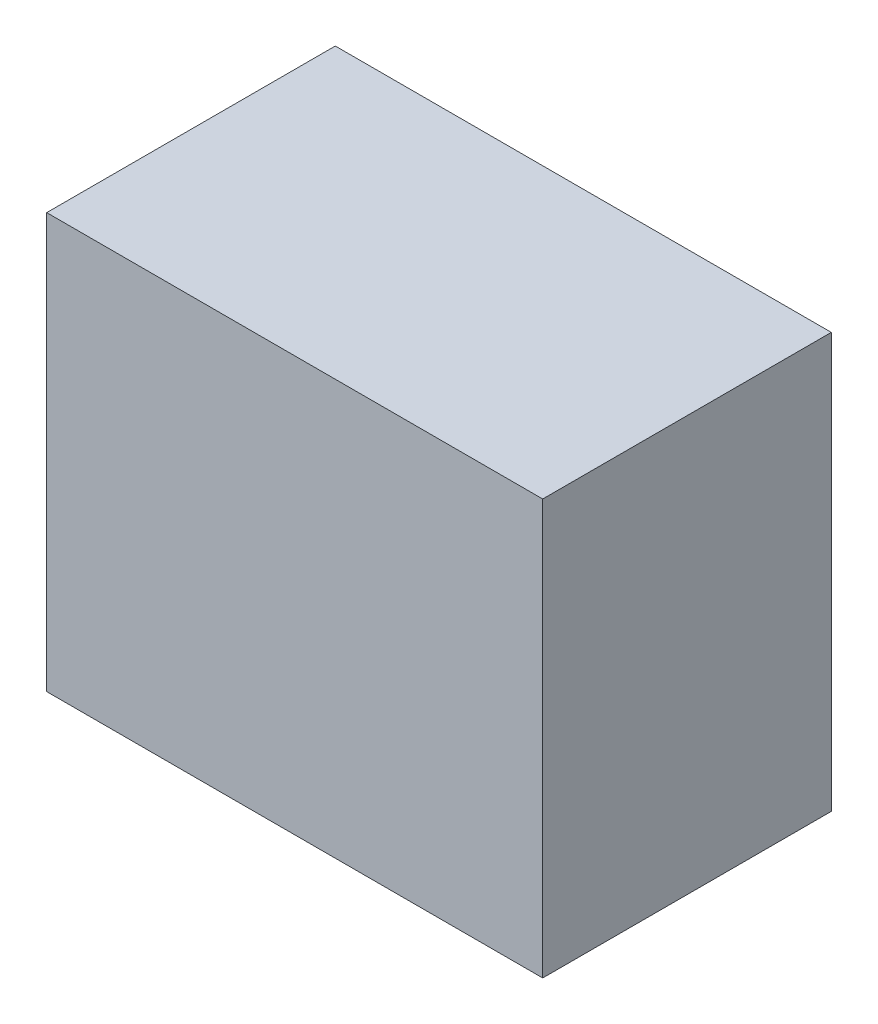
ISO-10303-21;
HEADER;
FILE_DESCRIPTION(('STEP AP214'),'2;1');
FILE_NAME('part.step','',(''),(''),'','','');
FILE_SCHEMA(('AUTOMOTIVE_DESIGN { 1 0 10303 214 1 1 1 1 }'));
ENDSEC;
DATA;
#1=APPLICATION_CONTEXT('core data for automotive mechanical design processes');
#2=APPLICATION_PROTOCOL_DEFINITION('international standard','automotive_design',2000,#1);
#3=PRODUCT_CONTEXT('',#1,'mechanical');
#4=PRODUCT('Part','Part','',(#3));
#5=PRODUCT_RELATED_PRODUCT_CATEGORY('part','',(#4));
#6=PRODUCT_DEFINITION_FORMATION('','',#4);
#7=PRODUCT_DEFINITION_CONTEXT('part definition',#1,'design');
#8=PRODUCT_DEFINITION('design','',#6,#7);
#9=PRODUCT_DEFINITION_SHAPE('','',#8);
#10=(LENGTH_UNIT() NAMED_UNIT(*) SI_UNIT(.MILLI.,.METRE.));
#11=(NAMED_UNIT(*) PLANE_ANGLE_UNIT() SI_UNIT($,.RADIAN.));
#12=(NAMED_UNIT(*) SI_UNIT($,.STERADIAN.) SOLID_ANGLE_UNIT());
#13=UNCERTAINTY_MEASURE_WITH_UNIT(LENGTH_MEASURE(1.E-05),#10,'distance_accuracy_value','');
#14=(GEOMETRIC_REPRESENTATION_CONTEXT(3) GLOBAL_UNCERTAINTY_ASSIGNED_CONTEXT((#13)) GLOBAL_UNIT_ASSIGNED_CONTEXT((#10,
#11,#12)) REPRESENTATION_CONTEXT('',''));
#15=CARTESIAN_POINT('',(0.,0.,0.));
#16=DIRECTION('',(0.,0.,1.));
#17=DIRECTION('',(1.,0.,0.));
#18=AXIS2_PLACEMENT_3D('',#15,#16,#17);
#19=CARTESIAN_POINT('',(-0.68749926,0.57500012,0.80000094));
#20=DIRECTION('',(0.,0.,-1.));
#21=DIRECTION('',(-1.,0.,0.));
#22=AXIS2_PLACEMENT_3D('',#19,#20,#21);
#23=PLANE('',#22);
#24=DIRECTION('',(1.,0.,0.));
#25=VECTOR('',#24,1.);
#26=CARTESIAN_POINT('',(-0.68749926,-0.57500012,0.80000094));
#27=LINE('',#26,#25);
#28=CARTESIAN_POINT('',(-0.68749926,-0.57500012,0.80000094));
#29=VERTEX_POINT('',#28);
#30=CARTESIAN_POINT('',(0.6875018,-0.57500012,0.80000094));
#31=VERTEX_POINT('',#30);
#32=EDGE_CURVE('E55',#29,#31,#27,.T.);
#33=ORIENTED_EDGE('',*,*,#32,.T.);
#34=DIRECTION('',(0.,1.,0.));
#35=VECTOR('',#34,1.);
#36=CARTESIAN_POINT('',(0.6875018,-0.57500012,0.80000094));
#37=LINE('',#36,#35);
#38=CARTESIAN_POINT('',(0.6875018,0.57500012,0.80000094));
#39=VERTEX_POINT('',#38);
#40=EDGE_CURVE('E57',#31,#39,#37,.T.);
#41=ORIENTED_EDGE('',*,*,#40,.T.);
#42=DIRECTION('',(1.,0.,0.));
#43=VECTOR('',#42,1.);
#44=CARTESIAN_POINT('',(0.6875018,0.57500012,0.80000094));
#45=LINE('',#44,#43);
#46=CARTESIAN_POINT('',(-0.68749926,0.57500012,0.80000094));
#47=VERTEX_POINT('',#46);
#48=EDGE_CURVE('E20',#39,#47,#45,.F.);
#49=ORIENTED_EDGE('',*,*,#48,.T.);
#50=DIRECTION('',(0.,1.,0.));
#51=VECTOR('',#50,1.);
#52=CARTESIAN_POINT('',(-0.68749926,0.57500012,0.80000094));
#53=LINE('',#52,#51);
#54=EDGE_CURVE('E80',#47,#29,#53,.F.);
#55=ORIENTED_EDGE('',*,*,#54,.T.);
#56=EDGE_LOOP('',(#33,#41,#49,#55));
#57=FACE_BOUND('',#56,.T.);
#58=ADVANCED_FACE('F17',(#57),#23,.F.);
#59=CARTESIAN_POINT('',(0.6875018,0.57500012,0.));
#60=DIRECTION('',(0.,-1.,0.));
#61=DIRECTION('',(0.,0.,-1.));
#62=AXIS2_PLACEMENT_3D('',#59,#60,#61);
#63=PLANE('',#62);
#64=DIRECTION('',(0.,0.,-1.));
#65=VECTOR('',#64,1.);
#66=CARTESIAN_POINT('',(-0.68749926,0.57500012,0.));
#67=LINE('',#66,#65);
#68=CARTESIAN_POINT('',(-0.68749926,0.57500012,0.));
#69=VERTEX_POINT('',#68);
#70=EDGE_CURVE('E68',#69,#47,#67,.F.);
#71=ORIENTED_EDGE('',*,*,#70,.T.);
#72=ORIENTED_EDGE('',*,*,#48,.F.);
#73=DIRECTION('',(0.,0.,1.));
#74=VECTOR('',#73,1.);
#75=CARTESIAN_POINT('',(0.6875018,0.57500012,0.));
#76=LINE('',#75,#74);
#77=CARTESIAN_POINT('',(0.6875018,0.57500012,0.));
#78=VERTEX_POINT('',#77);
#79=EDGE_CURVE('E63',#39,#78,#76,.F.);
#80=ORIENTED_EDGE('',*,*,#79,.T.);
#81=DIRECTION('',(-1.,0.,0.));
#82=VECTOR('',#81,1.);
#83=CARTESIAN_POINT('',(-0.68749926,0.57500012,0.));
#84=LINE('',#83,#82);
#85=EDGE_CURVE('E83',#69,#78,#84,.F.);
#86=ORIENTED_EDGE('',*,*,#85,.F.);
#87=EDGE_LOOP('',(#71,#72,#80,#86));
#88=FACE_BOUND('',#87,.T.);
#89=ADVANCED_FACE('F65',(#88),#63,.F.);
#90=CARTESIAN_POINT('',(0.6875018,-0.57500012,0.));
#91=DIRECTION('',(-1.,0.,0.));
#92=DIRECTION('',(0.,0.,1.));
#93=AXIS2_PLACEMENT_3D('',#90,#91,#92);
#94=PLANE('',#93);
#95=ORIENTED_EDGE('',*,*,#79,.F.);
#96=ORIENTED_EDGE('',*,*,#40,.F.);
#97=DIRECTION('',(0.,0.,1.));
#98=VECTOR('',#97,1.);
#99=CARTESIAN_POINT('',(0.6875018,-0.57500012,0.));
#100=LINE('',#99,#98);
#101=CARTESIAN_POINT('',(0.6875018,-0.57500012,0.));
#102=VERTEX_POINT('',#101);
#103=EDGE_CURVE('E75',#31,#102,#100,.F.);
#104=ORIENTED_EDGE('',*,*,#103,.T.);
#105=DIRECTION('',(0.,1.,0.));
#106=VECTOR('',#105,1.);
#107=CARTESIAN_POINT('',(0.6875018,0.57500012,0.));
#108=LINE('',#107,#106);
#109=EDGE_CURVE('E72',#78,#102,#108,.F.);
#110=ORIENTED_EDGE('',*,*,#109,.F.);
#111=EDGE_LOOP('',(#95,#96,#104,#110));
#112=FACE_BOUND('',#111,.T.);
#113=ADVANCED_FACE('F70',(#112),#94,.F.);
#114=CARTESIAN_POINT('',(-0.68749926,-0.57500012,0.));
#115=DIRECTION('',(0.,1.,0.));
#116=DIRECTION('',(0.,0.,1.));
#117=AXIS2_PLACEMENT_3D('',#114,#115,#116);
#118=PLANE('',#117);
#119=ORIENTED_EDGE('',*,*,#103,.F.);
#120=ORIENTED_EDGE('',*,*,#32,.F.);
#121=DIRECTION('',(0.,0.,-1.));
#122=VECTOR('',#121,1.);
#123=CARTESIAN_POINT('',(-0.68749926,-0.57500012,0.));
#124=LINE('',#123,#122);
#125=CARTESIAN_POINT('',(-0.68749926,-0.57500012,0.));
#126=VERTEX_POINT('',#125);
#127=EDGE_CURVE('E35',#29,#126,#124,.T.);
#128=ORIENTED_EDGE('',*,*,#127,.T.);
#129=DIRECTION('',(-1.,0.,0.));
#130=VECTOR('',#129,1.);
#131=CARTESIAN_POINT('',(-0.68749926,-0.57500012,0.));
#132=LINE('',#131,#130);
#133=EDGE_CURVE('E26',#102,#126,#132,.T.);
#134=ORIENTED_EDGE('',*,*,#133,.F.);
#135=EDGE_LOOP('',(#119,#120,#128,#134));
#136=FACE_BOUND('',#135,.T.);
#137=ADVANCED_FACE('F89',(#136),#118,.F.);
#138=CARTESIAN_POINT('',(-0.68749926,0.57500012,0.));
#139=DIRECTION('',(1.,0.,0.));
#140=DIRECTION('',(0.,0.,-1.));
#141=AXIS2_PLACEMENT_3D('',#138,#139,#140);
#142=PLANE('',#141);
#143=ORIENTED_EDGE('',*,*,#127,.F.);
#144=ORIENTED_EDGE('',*,*,#54,.F.);
#145=ORIENTED_EDGE('',*,*,#70,.F.);
#146=DIRECTION('',(0.,1.,0.));
#147=VECTOR('',#146,1.);
#148=CARTESIAN_POINT('',(-0.68749926,0.57500012,0.));
#149=LINE('',#148,#147);
#150=EDGE_CURVE('E11',#126,#69,#149,.T.);
#151=ORIENTED_EDGE('',*,*,#150,.F.);
#152=EDGE_LOOP('',(#143,#144,#145,#151));
#153=FACE_BOUND('',#152,.T.);
#154=ADVANCED_FACE('F91',(#153),#142,.F.);
#155=CARTESIAN_POINT('',(-0.68749926,0.57500012,0.));
#156=DIRECTION('',(0.,0.,-1.));
#157=DIRECTION('',(-1.,0.,0.));
#158=AXIS2_PLACEMENT_3D('',#155,#156,#157);
#159=PLANE('',#158);
#160=ORIENTED_EDGE('',*,*,#133,.T.);
#161=ORIENTED_EDGE('',*,*,#150,.T.);
#162=ORIENTED_EDGE('',*,*,#85,.T.);
#163=ORIENTED_EDGE('',*,*,#109,.T.);
#164=EDGE_LOOP('',(#160,#161,#162,#163));
#165=FACE_BOUND('',#164,.T.);
#166=ADVANCED_FACE('F88',(#165),#159,.T.);
#167=CLOSED_SHELL('',(#58,#89,#113,#137,#154,#166));
#168=MANIFOLD_SOLID_BREP('B1',#167);
#169=ADVANCED_BREP_SHAPE_REPRESENTATION('',(#18,#168),#14);
#170=SHAPE_DEFINITION_REPRESENTATION(#9,#169);
ENDSEC;
END-ISO-10303-21;
